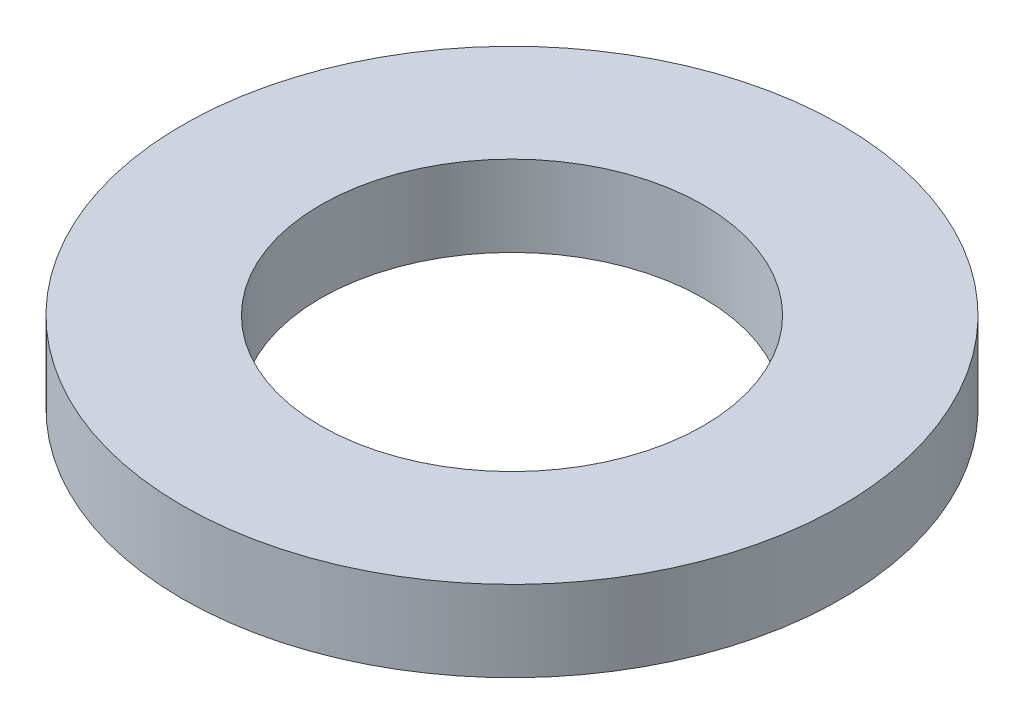
ISO-10303-21;
HEADER;
FILE_DESCRIPTION(('STEP AP214'),'2;1');
FILE_NAME('part.step','',(''),(''),'','','');
FILE_SCHEMA(('AUTOMOTIVE_DESIGN { 1 0 10303 214 1 1 1 1 }'));
ENDSEC;
DATA;
#1=APPLICATION_CONTEXT('core data for automotive mechanical design processes');
#2=APPLICATION_PROTOCOL_DEFINITION('international standard','automotive_design',2000,#1);
#3=PRODUCT_CONTEXT('',#1,'mechanical');
#4=PRODUCT('Part','Part','',(#3));
#5=PRODUCT_RELATED_PRODUCT_CATEGORY('part','',(#4));
#6=PRODUCT_DEFINITION_FORMATION('','',#4);
#7=PRODUCT_DEFINITION_CONTEXT('part definition',#1,'design');
#8=PRODUCT_DEFINITION('design','',#6,#7);
#9=PRODUCT_DEFINITION_SHAPE('','',#8);
#10=(LENGTH_UNIT() NAMED_UNIT(*) SI_UNIT(.MILLI.,.METRE.));
#11=(NAMED_UNIT(*) PLANE_ANGLE_UNIT() SI_UNIT($,.RADIAN.));
#12=(NAMED_UNIT(*) SI_UNIT($,.STERADIAN.) SOLID_ANGLE_UNIT());
#13=UNCERTAINTY_MEASURE_WITH_UNIT(LENGTH_MEASURE(1.E-05),#10,'distance_accuracy_value','');
#14=(GEOMETRIC_REPRESENTATION_CONTEXT(3) GLOBAL_UNCERTAINTY_ASSIGNED_CONTEXT((#13)) GLOBAL_UNIT_ASSIGNED_CONTEXT((#10,
#11,#12)) REPRESENTATION_CONTEXT('',''));
#15=CARTESIAN_POINT('',(0.,0.,0.));
#16=DIRECTION('',(0.,0.,1.));
#17=DIRECTION('',(1.,0.,0.));
#18=AXIS2_PLACEMENT_3D('',#15,#16,#17);
#19=CARTESIAN_POINT('',(0.,19.,0.));
#20=DIRECTION('',(0.,-1.,0.));
#21=DIRECTION('',(0.,0.,-1.));
#22=AXIS2_PLACEMENT_3D('',#19,#20,#21);
#23=CYLINDRICAL_SURFACE('',#22,77.5);
#24=CARTESIAN_POINT('',(0.,19.,0.));
#25=DIRECTION('',(0.,1.,0.));
#26=DIRECTION('',(0.,0.,1.));
#27=AXIS2_PLACEMENT_3D('',#24,#25,#26);
#28=CIRCLE('',#27,77.5);
#29=CARTESIAN_POINT('',(0.,19.,77.5));
#30=VERTEX_POINT('',#29);
#31=EDGE_CURVE('E10',#30,#30,#28,.T.);
#32=ORIENTED_EDGE('',*,*,#31,.F.);
#33=EDGE_LOOP('',(#32));
#34=FACE_BOUND('',#33,.T.);
#35=CARTESIAN_POINT('',(0.,0.,0.));
#36=DIRECTION('',(0.,1.,0.));
#37=DIRECTION('',(0.,0.,1.));
#38=AXIS2_PLACEMENT_3D('',#35,#36,#37);
#39=CIRCLE('',#38,77.5);
#40=CARTESIAN_POINT('',(0.,0.,77.5));
#41=VERTEX_POINT('',#40);
#42=EDGE_CURVE('E37',#41,#41,#39,.T.);
#43=ORIENTED_EDGE('',*,*,#42,.T.);
#44=EDGE_LOOP('',(#43));
#45=FACE_BOUND('',#44,.T.);
#46=ADVANCED_FACE('F40',(#34,#45),#23,.T.);
#47=CARTESIAN_POINT('',(0.,19.,0.));
#48=DIRECTION('',(0.,1.,0.));
#49=DIRECTION('',(0.,0.,1.));
#50=AXIS2_PLACEMENT_3D('',#47,#48,#49);
#51=PLANE('',#50);
#52=CARTESIAN_POINT('',(0.,19.,0.));
#53=DIRECTION('',(0.,1.,0.));
#54=DIRECTION('',(0.,0.,1.));
#55=AXIS2_PLACEMENT_3D('',#52,#53,#54);
#56=CIRCLE('',#55,45.);
#57=CARTESIAN_POINT('',(0.,19.,45.));
#58=VERTEX_POINT('',#57);
#59=EDGE_CURVE('E50',#58,#58,#56,.T.);
#60=ORIENTED_EDGE('',*,*,#59,.F.);
#61=EDGE_LOOP('',(#60));
#62=FACE_BOUND('',#61,.T.);
#63=ORIENTED_EDGE('',*,*,#31,.T.);
#64=EDGE_LOOP('',(#63));
#65=FACE_BOUND('',#64,.T.);
#66=ADVANCED_FACE('F59',(#62,#65),#51,.T.);
#67=CARTESIAN_POINT('',(0.,0.,0.));
#68=DIRECTION('',(0.,1.,0.));
#69=DIRECTION('',(0.,0.,1.));
#70=AXIS2_PLACEMENT_3D('',#67,#68,#69);
#71=PLANE('',#70);
#72=CARTESIAN_POINT('',(0.,0.,0.));
#73=DIRECTION('',(0.,1.,0.));
#74=DIRECTION('',(0.,0.,1.));
#75=AXIS2_PLACEMENT_3D('',#72,#73,#74);
#76=CIRCLE('',#75,45.);
#77=CARTESIAN_POINT('',(0.,0.,45.));
#78=VERTEX_POINT('',#77);
#79=EDGE_CURVE('E47',#78,#78,#76,.T.);
#80=ORIENTED_EDGE('',*,*,#79,.T.);
#81=EDGE_LOOP('',(#80));
#82=FACE_BOUND('',#81,.T.);
#83=ORIENTED_EDGE('',*,*,#42,.F.);
#84=EDGE_LOOP('',(#83));
#85=FACE_BOUND('',#84,.T.);
#86=ADVANCED_FACE('F58',(#82,#85),#71,.F.);
#87=CARTESIAN_POINT('',(0.,19.,0.));
#88=DIRECTION('',(0.,-1.,0.));
#89=DIRECTION('',(0.,0.,-1.));
#90=AXIS2_PLACEMENT_3D('',#87,#88,#89);
#91=CYLINDRICAL_SURFACE('',#90,45.);
#92=ORIENTED_EDGE('',*,*,#59,.T.);
#93=EDGE_LOOP('',(#92));
#94=FACE_BOUND('',#93,.T.);
#95=ORIENTED_EDGE('',*,*,#79,.F.);
#96=EDGE_LOOP('',(#95));
#97=FACE_BOUND('',#96,.T.);
#98=ADVANCED_FACE('F54',(#94,#97),#91,.F.);
#99=CLOSED_SHELL('',(#46,#66,#86,#98));
#100=MANIFOLD_SOLID_BREP('B2',#99);
#101=ADVANCED_BREP_SHAPE_REPRESENTATION('',(#18,#100),#14);
#102=SHAPE_DEFINITION_REPRESENTATION(#9,#101);
ENDSEC;
END-ISO-10303-21;
